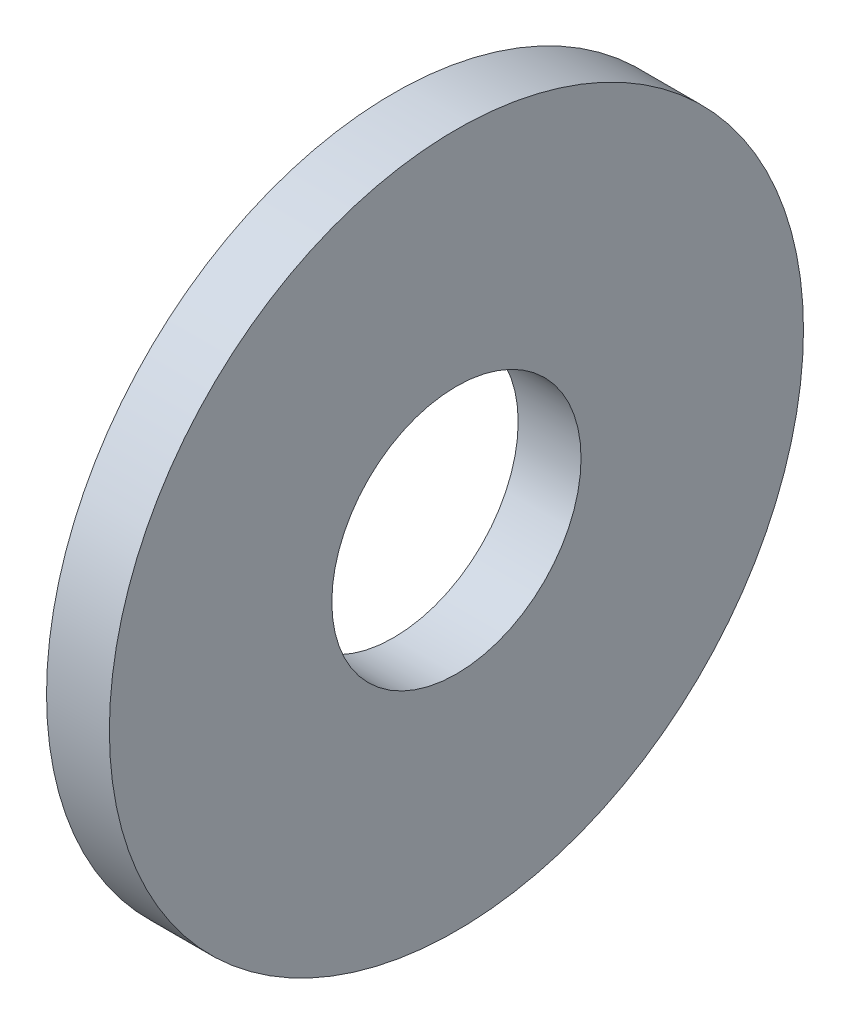
ISO-10303-21;
HEADER;
FILE_DESCRIPTION(('STEP AP214'),'2;1');
FILE_NAME('part.step','',(''),(''),'','','');
FILE_SCHEMA(('AUTOMOTIVE_DESIGN { 1 0 10303 214 1 1 1 1 }'));
ENDSEC;
DATA;
#1=APPLICATION_CONTEXT('core data for automotive mechanical design processes');
#2=APPLICATION_PROTOCOL_DEFINITION('international standard','automotive_design',2000,#1);
#3=PRODUCT_CONTEXT('',#1,'mechanical');
#4=PRODUCT('Part','Part','',(#3));
#5=PRODUCT_RELATED_PRODUCT_CATEGORY('part','',(#4));
#6=PRODUCT_DEFINITION_FORMATION('','',#4);
#7=PRODUCT_DEFINITION_CONTEXT('part definition',#1,'design');
#8=PRODUCT_DEFINITION('design','',#6,#7);
#9=PRODUCT_DEFINITION_SHAPE('','',#8);
#10=(LENGTH_UNIT() NAMED_UNIT(*) SI_UNIT(.MILLI.,.METRE.));
#11=(NAMED_UNIT(*) PLANE_ANGLE_UNIT() SI_UNIT($,.RADIAN.));
#12=(NAMED_UNIT(*) SI_UNIT($,.STERADIAN.) SOLID_ANGLE_UNIT());
#13=UNCERTAINTY_MEASURE_WITH_UNIT(LENGTH_MEASURE(1.E-05),#10,'distance_accuracy_value','');
#14=(GEOMETRIC_REPRESENTATION_CONTEXT(3) GLOBAL_UNCERTAINTY_ASSIGNED_CONTEXT((#13)) GLOBAL_UNIT_ASSIGNED_CONTEXT((#10,
#11,#12)) REPRESENTATION_CONTEXT('',''));
#15=CARTESIAN_POINT('',(0.,0.,0.));
#16=DIRECTION('',(0.,0.,1.));
#17=DIRECTION('',(1.,0.,0.));
#18=AXIS2_PLACEMENT_3D('',#15,#16,#17);
#19=CARTESIAN_POINT('',(-34.9249999999999,0.,0.));
#20=DIRECTION('',(-1.,0.,0.));
#21=DIRECTION('',(0.,0.,1.));
#22=AXIS2_PLACEMENT_3D('',#19,#20,#21);
#23=CYLINDRICAL_SURFACE('',#22,4.56);
#24=CARTESIAN_POINT('',(0.,0.,0.));
#25=DIRECTION('',(-1.,0.,0.));
#26=DIRECTION('',(0.,0.,1.));
#27=AXIS2_PLACEMENT_3D('',#24,#25,#26);
#28=CIRCLE('',#27,4.56);
#29=CARTESIAN_POINT('',(0.,0.,4.56));
#30=VERTEX_POINT('',#29);
#31=EDGE_CURVE('E10',#30,#30,#28,.T.);
#32=ORIENTED_EDGE('',*,*,#31,.F.);
#33=EDGE_LOOP('',(#32));
#34=FACE_BOUND('',#33,.T.);
#35=CARTESIAN_POINT('',(-2.3,0.,0.));
#36=DIRECTION('',(-1.,0.,0.));
#37=DIRECTION('',(0.,0.,1.));
#38=AXIS2_PLACEMENT_3D('',#35,#36,#37);
#39=CIRCLE('',#38,4.56);
#40=CARTESIAN_POINT('',(-2.3,0.,4.56));
#41=VERTEX_POINT('',#40);
#42=EDGE_CURVE('E45',#41,#41,#39,.T.);
#43=ORIENTED_EDGE('',*,*,#42,.T.);
#44=EDGE_LOOP('',(#43));
#45=FACE_BOUND('',#44,.T.);
#46=ADVANCED_FACE('F31',(#34,#45),#23,.F.);
#47=CARTESIAN_POINT('',(0.,4.56,0.));
#48=DIRECTION('',(-1.,0.,0.));
#49=DIRECTION('',(0.,0.,1.));
#50=AXIS2_PLACEMENT_3D('',#47,#48,#49);
#51=PLANE('',#50);
#52=CARTESIAN_POINT('',(0.,0.,0.));
#53=DIRECTION('',(-1.,0.,0.));
#54=DIRECTION('',(0.,0.,1.));
#55=AXIS2_PLACEMENT_3D('',#52,#53,#54);
#56=CIRCLE('',#55,12.7);
#57=CARTESIAN_POINT('',(0.,0.,12.7));
#58=VERTEX_POINT('',#57);
#59=EDGE_CURVE('E37',#58,#58,#56,.T.);
#60=ORIENTED_EDGE('',*,*,#59,.F.);
#61=EDGE_LOOP('',(#60));
#62=FACE_BOUND('',#61,.T.);
#63=ORIENTED_EDGE('',*,*,#31,.T.);
#64=EDGE_LOOP('',(#63));
#65=FACE_BOUND('',#64,.T.);
#66=ADVANCED_FACE('F60',(#62,#65),#51,.F.);
#67=CARTESIAN_POINT('',(-34.9249999999999,0.,0.));
#68=DIRECTION('',(-1.,0.,0.));
#69=DIRECTION('',(0.,0.,1.));
#70=AXIS2_PLACEMENT_3D('',#67,#68,#69);
#71=CYLINDRICAL_SURFACE('',#70,12.7);
#72=CARTESIAN_POINT('',(-2.3,0.,0.));
#73=DIRECTION('',(-1.,0.,0.));
#74=DIRECTION('',(0.,0.,1.));
#75=AXIS2_PLACEMENT_3D('',#72,#73,#74);
#76=CIRCLE('',#75,12.7);
#77=CARTESIAN_POINT('',(-2.3,0.,12.7));
#78=VERTEX_POINT('',#77);
#79=EDGE_CURVE('E41',#78,#78,#76,.T.);
#80=ORIENTED_EDGE('',*,*,#79,.F.);
#81=EDGE_LOOP('',(#80));
#82=FACE_BOUND('',#81,.T.);
#83=ORIENTED_EDGE('',*,*,#59,.T.);
#84=EDGE_LOOP('',(#83));
#85=FACE_BOUND('',#84,.T.);
#86=ADVANCED_FACE('F55',(#82,#85),#71,.T.);
#87=CARTESIAN_POINT('',(-2.3,12.7,0.));
#88=DIRECTION('',(1.,0.,0.));
#89=DIRECTION('',(0.,0.,-1.));
#90=AXIS2_PLACEMENT_3D('',#87,#88,#89);
#91=PLANE('',#90);
#92=ORIENTED_EDGE('',*,*,#42,.F.);
#93=EDGE_LOOP('',(#92));
#94=FACE_BOUND('',#93,.T.);
#95=ORIENTED_EDGE('',*,*,#79,.T.);
#96=EDGE_LOOP('',(#95));
#97=FACE_BOUND('',#96,.T.);
#98=ADVANCED_FACE('F52',(#94,#97),#91,.F.);
#99=CLOSED_SHELL('',(#46,#66,#86,#98));
#100=MANIFOLD_SOLID_BREP('B2',#99);
#101=ADVANCED_BREP_SHAPE_REPRESENTATION('',(#18,#100),#14);
#102=SHAPE_DEFINITION_REPRESENTATION(#9,#101);
ENDSEC;
END-ISO-10303-21;
